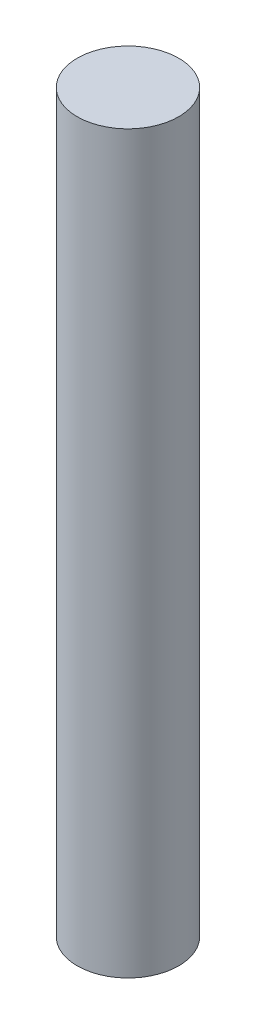
ISO-10303-21;
HEADER;
FILE_DESCRIPTION(('STEP AP214'),'2;1');
FILE_NAME('part.step','',(''),(''),'','','');
FILE_SCHEMA(('AUTOMOTIVE_DESIGN { 1 0 10303 214 1 1 1 1 }'));
ENDSEC;
DATA;
#1=APPLICATION_CONTEXT('core data for automotive mechanical design processes');
#2=APPLICATION_PROTOCOL_DEFINITION('international standard','automotive_design',2000,#1);
#3=PRODUCT_CONTEXT('',#1,'mechanical');
#4=PRODUCT('Part','Part','',(#3));
#5=PRODUCT_RELATED_PRODUCT_CATEGORY('part','',(#4));
#6=PRODUCT_DEFINITION_FORMATION('','',#4);
#7=PRODUCT_DEFINITION_CONTEXT('part definition',#1,'design');
#8=PRODUCT_DEFINITION('design','',#6,#7);
#9=PRODUCT_DEFINITION_SHAPE('','',#8);
#10=(LENGTH_UNIT() NAMED_UNIT(*) SI_UNIT(.MILLI.,.METRE.));
#11=(NAMED_UNIT(*) PLANE_ANGLE_UNIT() SI_UNIT($,.RADIAN.));
#12=(NAMED_UNIT(*) SI_UNIT($,.STERADIAN.) SOLID_ANGLE_UNIT());
#13=UNCERTAINTY_MEASURE_WITH_UNIT(LENGTH_MEASURE(1.E-05),#10,'distance_accuracy_value','');
#14=(GEOMETRIC_REPRESENTATION_CONTEXT(3) GLOBAL_UNCERTAINTY_ASSIGNED_CONTEXT((#13)) GLOBAL_UNIT_ASSIGNED_CONTEXT((#10,
#11,#12)) REPRESENTATION_CONTEXT('',''));
#15=CARTESIAN_POINT('',(0.,0.,0.));
#16=DIRECTION('',(0.,0.,1.));
#17=DIRECTION('',(1.,0.,0.));
#18=AXIS2_PLACEMENT_3D('',#15,#16,#17);
#19=CARTESIAN_POINT('',(0.,25.4,0.));
#20=DIRECTION('',(0.,-1.,0.));
#21=DIRECTION('',(0.,0.,-1.));
#22=AXIS2_PLACEMENT_3D('',#19,#20,#21);
#23=CYLINDRICAL_SURFACE('',#22,1.7526);
#24=CARTESIAN_POINT('',(0.,25.4,0.));
#25=DIRECTION('',(0.,1.,0.));
#26=DIRECTION('',(0.,0.,1.));
#27=AXIS2_PLACEMENT_3D('',#24,#25,#26);
#28=CIRCLE('',#27,1.7526);
#29=CARTESIAN_POINT('',(0.,25.4,1.7526));
#30=VERTEX_POINT('',#29);
#31=EDGE_CURVE('E10',#30,#30,#28,.T.);
#32=ORIENTED_EDGE('',*,*,#31,.F.);
#33=EDGE_LOOP('',(#32));
#34=FACE_BOUND('',#33,.T.);
#35=CARTESIAN_POINT('',(0.,0.,0.));
#36=DIRECTION('',(0.,1.,0.));
#37=DIRECTION('',(0.,0.,1.));
#38=AXIS2_PLACEMENT_3D('',#35,#36,#37);
#39=CIRCLE('',#38,1.7526);
#40=CARTESIAN_POINT('',(0.,0.,1.7526));
#41=VERTEX_POINT('',#40);
#42=EDGE_CURVE('E34',#41,#41,#39,.T.);
#43=ORIENTED_EDGE('',*,*,#42,.T.);
#44=EDGE_LOOP('',(#43));
#45=FACE_BOUND('',#44,.T.);
#46=ADVANCED_FACE('F31',(#34,#45),#23,.T.);
#47=CARTESIAN_POINT('',(0.,25.4,0.));
#48=DIRECTION('',(0.,1.,0.));
#49=DIRECTION('',(0.,0.,1.));
#50=AXIS2_PLACEMENT_3D('',#47,#48,#49);
#51=PLANE('',#50);
#52=ORIENTED_EDGE('',*,*,#31,.T.);
#53=EDGE_LOOP('',(#52));
#54=FACE_BOUND('',#53,.T.);
#55=ADVANCED_FACE('F46',(#54),#51,.T.);
#56=CARTESIAN_POINT('',(0.,0.,0.));
#57=DIRECTION('',(0.,1.,0.));
#58=DIRECTION('',(0.,0.,1.));
#59=AXIS2_PLACEMENT_3D('',#56,#57,#58);
#60=PLANE('',#59);
#61=ORIENTED_EDGE('',*,*,#42,.F.);
#62=EDGE_LOOP('',(#61));
#63=FACE_BOUND('',#62,.T.);
#64=ADVANCED_FACE('F44',(#63),#60,.F.);
#65=CLOSED_SHELL('',(#46,#55,#64));
#66=MANIFOLD_SOLID_BREP('B2',#65);
#67=ADVANCED_BREP_SHAPE_REPRESENTATION('',(#18,#66),#14);
#68=SHAPE_DEFINITION_REPRESENTATION(#9,#67);
ENDSEC;
END-ISO-10303-21;
